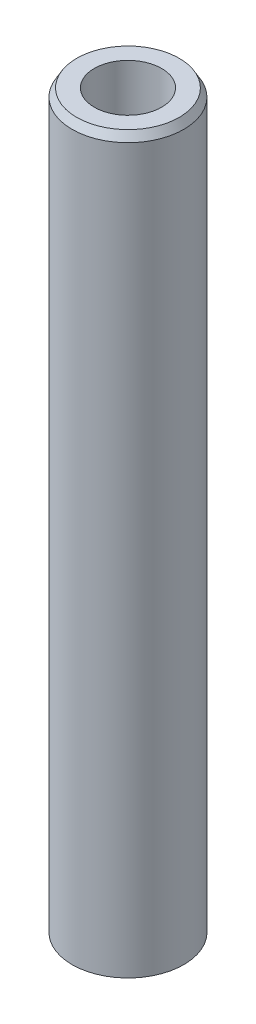
ISO-10303-21;
HEADER;
FILE_DESCRIPTION(('STEP AP214'),'2;1');
FILE_NAME('part.step','',(''),(''),'','','');
FILE_SCHEMA(('AUTOMOTIVE_DESIGN { 1 0 10303 214 1 1 1 1 }'));
ENDSEC;
DATA;
#1=APPLICATION_CONTEXT('core data for automotive mechanical design processes');
#2=APPLICATION_PROTOCOL_DEFINITION('international standard','automotive_design',2000,#1);
#3=PRODUCT_CONTEXT('',#1,'mechanical');
#4=PRODUCT('Part','Part','',(#3));
#5=PRODUCT_RELATED_PRODUCT_CATEGORY('part','',(#4));
#6=PRODUCT_DEFINITION_FORMATION('','',#4);
#7=PRODUCT_DEFINITION_CONTEXT('part definition',#1,'design');
#8=PRODUCT_DEFINITION('design','',#6,#7);
#9=PRODUCT_DEFINITION_SHAPE('','',#8);
#10=(LENGTH_UNIT() NAMED_UNIT(*) SI_UNIT(.MILLI.,.METRE.));
#11=(NAMED_UNIT(*) PLANE_ANGLE_UNIT() SI_UNIT($,.RADIAN.));
#12=(NAMED_UNIT(*) SI_UNIT($,.STERADIAN.) SOLID_ANGLE_UNIT());
#13=UNCERTAINTY_MEASURE_WITH_UNIT(LENGTH_MEASURE(1.E-05),#10,'distance_accuracy_value','');
#14=(GEOMETRIC_REPRESENTATION_CONTEXT(3) GLOBAL_UNCERTAINTY_ASSIGNED_CONTEXT((#13)) GLOBAL_UNIT_ASSIGNED_CONTEXT((#10,
#11,#12)) REPRESENTATION_CONTEXT('',''));
#15=CARTESIAN_POINT('',(0.,0.,0.));
#16=DIRECTION('',(0.,0.,1.));
#17=DIRECTION('',(1.,0.,0.));
#18=AXIS2_PLACEMENT_3D('',#15,#16,#17);
#19=CARTESIAN_POINT('',(0.,395.231846825205,0.));
#20=DIRECTION('',(0.,-1.,0.));
#21=DIRECTION('',(0.,0.,-1.));
#22=AXIS2_PLACEMENT_3D('',#19,#20,#21);
#23=CYLINDRICAL_SURFACE('',#22,30.);
#24=CARTESIAN_POINT('',(0.,390.916752848105,0.));
#25=DIRECTION('',(0.,1.,0.));
#26=DIRECTION('',(0.,0.,1.));
#27=AXIS2_PLACEMENT_3D('',#24,#25,#26);
#28=CIRCLE('',#27,30.);
#29=CARTESIAN_POINT('',(0.,390.916752848105,30.));
#30=VERTEX_POINT('',#29);
#31=EDGE_CURVE('E50',#30,#30,#28,.F.);
#32=ORIENTED_EDGE('',*,*,#31,.T.);
#33=EDGE_LOOP('',(#32));
#34=FACE_BOUND('',#33,.T.);
#35=CARTESIAN_POINT('',(0.,2.49132066925711,0.));
#36=DIRECTION('',(0.,1.,0.));
#37=DIRECTION('',(0.,0.,1.));
#38=AXIS2_PLACEMENT_3D('',#35,#36,#37);
#39=CIRCLE('',#38,30.);
#40=CARTESIAN_POINT('',(0.,2.49132066925711,30.));
#41=VERTEX_POINT('',#40);
#42=EDGE_CURVE('E51',#41,#41,#39,.T.);
#43=ORIENTED_EDGE('',*,*,#42,.T.);
#44=EDGE_LOOP('',(#43));
#45=FACE_BOUND('',#44,.T.);
#46=ADVANCED_FACE('F39',(#34,#45),#23,.T.);
#47=CARTESIAN_POINT('',(0.,395.231846825205,0.));
#48=DIRECTION('',(0.,1.,0.));
#49=DIRECTION('',(0.,0.,1.));
#50=AXIS2_PLACEMENT_3D('',#47,#48,#49);
#51=PLANE('',#50);
#52=CARTESIAN_POINT('',(0.,395.231846825205,0.));
#53=DIRECTION('',(0.,1.,0.));
#54=DIRECTION('',(0.,0.,1.));
#55=AXIS2_PLACEMENT_3D('',#52,#53,#54);
#56=CIRCLE('',#55,27.5086793307429);
#57=CARTESIAN_POINT('',(0.,395.231846825205,27.5086793307429));
#58=VERTEX_POINT('',#57);
#59=EDGE_CURVE('E54',#58,#58,#56,.T.);
#60=ORIENTED_EDGE('',*,*,#59,.T.);
#61=EDGE_LOOP('',(#60));
#62=FACE_BOUND('',#61,.T.);
#63=CARTESIAN_POINT('',(0.,395.231846825205,0.));
#64=DIRECTION('',(0.,1.,0.));
#65=DIRECTION('',(0.,0.,1.));
#66=AXIS2_PLACEMENT_3D('',#63,#64,#65);
#67=CIRCLE('',#66,18.0727539003788);
#68=CARTESIAN_POINT('',(0.,395.231846825205,18.0727539003788));
#69=VERTEX_POINT('',#68);
#70=EDGE_CURVE('E58',#69,#69,#67,.T.);
#71=ORIENTED_EDGE('',*,*,#70,.F.);
#72=EDGE_LOOP('',(#71));
#73=FACE_BOUND('',#72,.T.);
#74=ADVANCED_FACE('F69',(#62,#73),#51,.T.);
#75=CARTESIAN_POINT('',(0.,0.,0.));
#76=DIRECTION('',(0.,1.,0.));
#77=DIRECTION('',(0.,0.,1.));
#78=AXIS2_PLACEMENT_3D('',#75,#76,#77);
#79=PLANE('',#78);
#80=CARTESIAN_POINT('',(0.,0.,0.));
#81=DIRECTION('',(0.,1.,0.));
#82=DIRECTION('',(0.,0.,1.));
#83=AXIS2_PLACEMENT_3D('',#80,#81,#82);
#84=CIRCLE('',#83,25.6849060229001);
#85=CARTESIAN_POINT('',(0.,0.,25.6849060229001));
#86=VERTEX_POINT('',#85);
#87=EDGE_CURVE('E10',#86,#86,#84,.F.);
#88=ORIENTED_EDGE('',*,*,#87,.T.);
#89=EDGE_LOOP('',(#88));
#90=FACE_BOUND('',#89,.T.);
#91=CARTESIAN_POINT('',(0.,0.,0.));
#92=DIRECTION('',(0.,1.,0.));
#93=DIRECTION('',(0.,0.,1.));
#94=AXIS2_PLACEMENT_3D('',#91,#92,#93);
#95=CIRCLE('',#94,18.0727539003788);
#96=CARTESIAN_POINT('',(0.,0.,18.0727539003788));
#97=VERTEX_POINT('',#96);
#98=EDGE_CURVE('E63',#97,#97,#95,.T.);
#99=ORIENTED_EDGE('',*,*,#98,.T.);
#100=EDGE_LOOP('',(#99));
#101=FACE_BOUND('',#100,.T.);
#102=ADVANCED_FACE('F75',(#90,#101),#79,.F.);
#103=CARTESIAN_POINT('',(0.,395.231846825205,0.));
#104=DIRECTION('',(0.,-1.,0.));
#105=DIRECTION('',(0.,0.,-1.));
#106=AXIS2_PLACEMENT_3D('',#103,#104,#105);
#107=CYLINDRICAL_SURFACE('',#106,18.0727539003788);
#108=ORIENTED_EDGE('',*,*,#70,.T.);
#109=EDGE_LOOP('',(#108));
#110=FACE_BOUND('',#109,.T.);
#111=ORIENTED_EDGE('',*,*,#98,.F.);
#112=EDGE_LOOP('',(#111));
#113=FACE_BOUND('',#112,.T.);
#114=ADVANCED_FACE('F70',(#110,#113),#107,.F.);
#115=CARTESIAN_POINT('',(0.,395.231846825205,0.));
#116=DIRECTION('',(0.,-1.,0.));
#117=DIRECTION('',(0.,0.,-1.));
#118=AXIS2_PLACEMENT_3D('',#115,#116,#117);
#119=CONICAL_SURFACE('',#118,27.5086793307429,0.523598775598298);
#120=ORIENTED_EDGE('',*,*,#31,.F.);
#121=EDGE_LOOP('',(#120));
#122=FACE_BOUND('',#121,.T.);
#123=ORIENTED_EDGE('',*,*,#59,.F.);
#124=EDGE_LOOP('',(#123));
#125=FACE_BOUND('',#124,.T.);
#126=ADVANCED_FACE('F81',(#122,#125),#119,.T.);
#127=CARTESIAN_POINT('',(0.,2.49132066925711,0.));
#128=DIRECTION('',(0.,1.,0.));
#129=DIRECTION('',(0.,0.,1.));
#130=AXIS2_PLACEMENT_3D('',#127,#128,#129);
#131=CONICAL_SURFACE('',#130,30.,1.04719755119661);
#132=CARTESIAN_POINT('',(0.,0.,25.6849060229001));
#133=CARTESIAN_POINT('',(0.,0.0259512569714282,25.7298549184949));
#134=CARTESIAN_POINT('',(0.,0.0519025139428564,25.7748038140897));
#135=CARTESIAN_POINT('',(0.,0.103805027885713,25.8647016052792));
#136=CARTESIAN_POINT('',(0.,0.129756284857141,25.909650500874));
#137=CARTESIAN_POINT('',(0.,0.181658798799997,25.9995482920636));
#138=CARTESIAN_POINT('',(0.,0.207610055771425,26.0444971876584));
#139=CARTESIAN_POINT('',(0.,0.259512569714282,26.134394978848));
#140=CARTESIAN_POINT('',(0.,0.285463826685711,26.1793438744428));
#141=CARTESIAN_POINT('',(0.,0.337366340628567,26.2692416656324));
#142=CARTESIAN_POINT('',(0.,0.363317597599995,26.3141905612271));
#143=CARTESIAN_POINT('',(0.,0.415220111542852,26.4040883524167));
#144=CARTESIAN_POINT('',(0.,0.44117136851428,26.4490372480115));
#145=CARTESIAN_POINT('',(0.,0.493073882457137,26.5389350392011));
#146=CARTESIAN_POINT('',(0.,0.519025139428565,26.5838839347959));
#147=CARTESIAN_POINT('',(0.,0.570927653371421,26.6737817259855));
#148=CARTESIAN_POINT('',(0.,0.596878910342849,26.7187306215803));
#149=CARTESIAN_POINT('',(0.,0.648781424285706,26.8086284127698));
#150=CARTESIAN_POINT('',(0.,0.674732681257134,26.8535773083646));
#151=CARTESIAN_POINT('',(0.,0.726635195199991,26.9434750995542));
#152=CARTESIAN_POINT('',(0.,0.752586452171419,26.988423995149));
#153=CARTESIAN_POINT('',(0.,0.804488966114275,27.0783217863386));
#154=CARTESIAN_POINT('',(0.,0.830440223085704,27.1232706819334));
#155=CARTESIAN_POINT('',(0.,0.88234273702856,27.213168473123));
#156=CARTESIAN_POINT('',(0.,0.908293993999988,27.2581173687178));
#157=CARTESIAN_POINT('',(0.,0.960196507942845,27.3480151599073));
#158=CARTESIAN_POINT('',(0.,0.986147764914274,27.3929640555021));
#159=CARTESIAN_POINT('',(0.,1.03805027885713,27.4828618466917));
#160=CARTESIAN_POINT('',(0.,1.06400153582856,27.5278107422865));
#161=CARTESIAN_POINT('',(0.,1.11590404977141,27.6177085334761));
#162=CARTESIAN_POINT('',(0.,1.14185530674284,27.6626574290709));
#163=CARTESIAN_POINT('',(0.,1.1937578206857,27.7525552202605));
#164=CARTESIAN_POINT('',(0.,1.21970907765713,27.7975041158552));
#165=CARTESIAN_POINT('',(0.,1.27161159159998,27.8874019070448));
#166=CARTESIAN_POINT('',(0.,1.29756284857141,27.9323508026396));
#167=CARTESIAN_POINT('',(0.,1.34946536251427,28.0222485938292));
#168=CARTESIAN_POINT('',(0.,1.3754166194857,28.067197489424));
#169=CARTESIAN_POINT('',(0.,1.42731913342855,28.1570952806136));
#170=CARTESIAN_POINT('',(0.,1.45327039039998,28.2020441762084));
#171=CARTESIAN_POINT('',(0.,1.50517290434284,28.2919419673979));
#172=CARTESIAN_POINT('',(0.,1.53112416131427,28.3368908629927));
#173=CARTESIAN_POINT('',(0.,1.58302667525712,28.4267886541823));
#174=CARTESIAN_POINT('',(0.,1.60897793222855,28.4717375497771));
#175=CARTESIAN_POINT('',(0.,1.66088044617141,28.5616353409667));
#176=CARTESIAN_POINT('',(0.,1.68683170314284,28.6065842365615));
#177=CARTESIAN_POINT('',(0.,1.73873421708569,28.6964820277511));
#178=CARTESIAN_POINT('',(0.,1.76468547405712,28.7414309233459));
#179=CARTESIAN_POINT('',(0.,1.81658798799998,28.8313287145354));
#180=CARTESIAN_POINT('',(0.,1.84253924497141,28.8762776101302));
#181=CARTESIAN_POINT('',(0.,1.89444175891426,28.9661754013198));
#182=CARTESIAN_POINT('',(0.,1.92039301588569,29.0111242969146));
#183=CARTESIAN_POINT('',(0.,1.97229552982855,29.1010220881042));
#184=CARTESIAN_POINT('',(0.,1.99824678679998,29.145970983699));
#185=CARTESIAN_POINT('',(0.,2.05014930074283,29.2358687748886));
#186=CARTESIAN_POINT('',(0.,2.07610055771426,29.2808176704833));
#187=CARTESIAN_POINT('',(0.,2.12800307165712,29.3707154616729));
#188=CARTESIAN_POINT('',(0.,2.15395432862855,29.4156643572677));
#189=CARTESIAN_POINT('',(0.,2.2058568425714,29.5055621484573));
#190=CARTESIAN_POINT('',(0.,2.23180809954283,29.5505110440521));
#191=CARTESIAN_POINT('',(0.,2.28371061348569,29.6404088352417));
#192=CARTESIAN_POINT('',(0.,2.30966187045712,29.6853577308365));
#193=CARTESIAN_POINT('',(0.,2.36156438439997,29.775255522026));
#194=CARTESIAN_POINT('',(0.,2.3875156413714,29.8202044176208));
#195=CARTESIAN_POINT('',(0.,2.43941815531426,29.9101022088104));
#196=CARTESIAN_POINT('',(0.,2.46536941228568,29.9550511044052));
#197=CARTESIAN_POINT('',(0.,2.49132066925711,30.));
#198=B_SPLINE_CURVE_WITH_KNOTS('',3,(#132,#133,#134,#135,#136,#137,#138,#139,#140,#141,#142,
#143,#144,#145,#146,#147,#148,#149,#150,#151,#152,#153,#154,#155,#156,#157,#158,#159,#160,#161,
#162,#163,#164,#165,#166,#167,#168,#169,#170,#171,#172,#173,#174,#175,#176,#177,#178,#179,#180,
#181,#182,#183,#184,#185,#186,#187,#188,#189,#190,#191,#192,#193,#194,#195,#196,#197),
.UNSPECIFIED.,.F.,.F.,(4,2,2,2,2,2,2,2,2,2,2,2,2,2,2,2,2,2,2,2,2,2,2,2,2,2,2,2,2,2,2,2,4),(0.,
0.15570754182857,0.311415083657143,0.467122625485716,0.622830167314286,0.778537709142859,
0.934245250971432,1.08995279280001,1.24566033462858,1.40136787645715,1.55707541828572,
1.71278296011429,1.86849050194287,2.02419804377144,2.17990558560001,2.33561312742858,
2.49132066925716,2.64702821108573,2.8027357529143,2.95844329474287,3.11415083657145,
3.26985837840002,3.42556592022859,3.58127346205716,3.73698100388574,3.89268854571431,
4.04839608754288,4.20410362937145,4.35981117120002,4.5155187130286,4.67122625485717,
4.82693379668574,4.98264133851431),.UNSPECIFIED.);
#199=EDGE_CURVE('BSEAM45',#86,#41,#198,.T.);
#200=ORIENTED_EDGE('',*,*,#87,.F.);
#201=ORIENTED_EDGE('',*,*,#42,.F.);
#202=ORIENTED_EDGE('',*,*,#199,.T.);
#203=ORIENTED_EDGE('',*,*,#199,.F.);
#204=EDGE_LOOP('',(#200,#202,#201,#203));
#205=FACE_BOUND('',#204,.T.);
#206=ADVANCED_FACE('F45',(#205),#131,.T.);
#207=CLOSED_SHELL('',(#46,#74,#102,#114,#126,#206));
#208=MANIFOLD_SOLID_BREP('B2',#207);
#209=ADVANCED_BREP_SHAPE_REPRESENTATION('',(#18,#208),#14);
#210=SHAPE_DEFINITION_REPRESENTATION(#9,#209);
ENDSEC;
END-ISO-10303-21;
